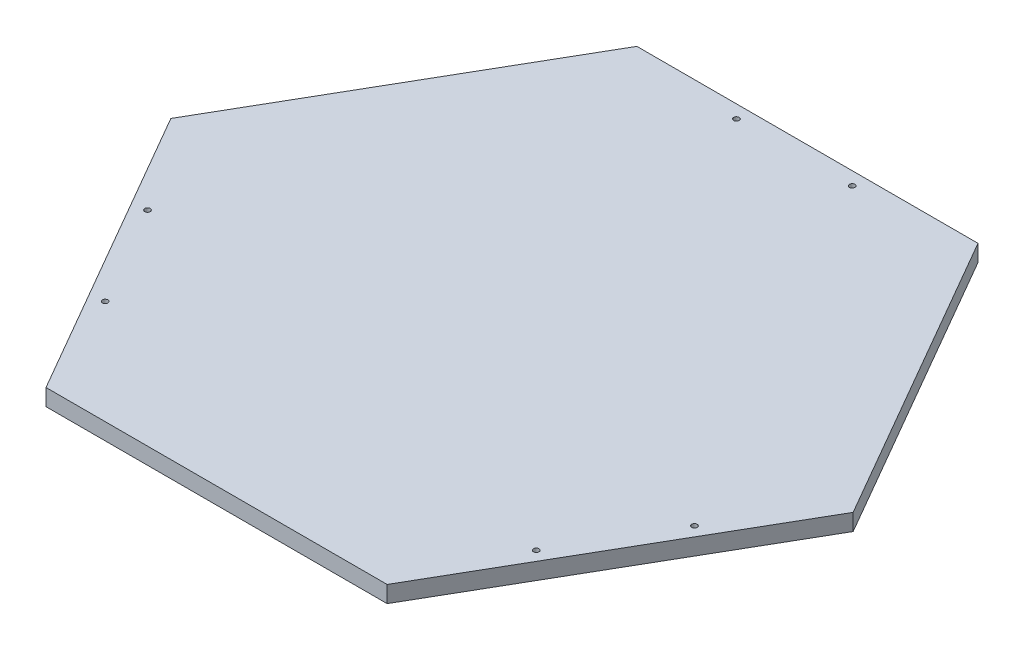
ISO-10303-21;
HEADER;
FILE_DESCRIPTION(('STEP AP214'),'2;1');
FILE_NAME('part.step','',(''),(''),'','','');
FILE_SCHEMA(('AUTOMOTIVE_DESIGN { 1 0 10303 214 1 1 1 1 }'));
ENDSEC;
DATA;
#1=APPLICATION_CONTEXT('core data for automotive mechanical design processes');
#2=APPLICATION_PROTOCOL_DEFINITION('international standard','automotive_design',2000,#1);
#3=PRODUCT_CONTEXT('',#1,'mechanical');
#4=PRODUCT('Part','Part','',(#3));
#5=PRODUCT_RELATED_PRODUCT_CATEGORY('part','',(#4));
#6=PRODUCT_DEFINITION_FORMATION('','',#4);
#7=PRODUCT_DEFINITION_CONTEXT('part definition',#1,'design');
#8=PRODUCT_DEFINITION('design','',#6,#7);
#9=PRODUCT_DEFINITION_SHAPE('','',#8);
#10=(LENGTH_UNIT() NAMED_UNIT(*) SI_UNIT(.MILLI.,.METRE.));
#11=(NAMED_UNIT(*) PLANE_ANGLE_UNIT() SI_UNIT($,.RADIAN.));
#12=(NAMED_UNIT(*) SI_UNIT($,.STERADIAN.) SOLID_ANGLE_UNIT());
#13=UNCERTAINTY_MEASURE_WITH_UNIT(LENGTH_MEASURE(1.E-05),#10,'distance_accuracy_value','');
#14=(GEOMETRIC_REPRESENTATION_CONTEXT(3) GLOBAL_UNCERTAINTY_ASSIGNED_CONTEXT((#13)) GLOBAL_UNIT_ASSIGNED_CONTEXT((#10,
#11,#12)) REPRESENTATION_CONTEXT('',''));
#15=CARTESIAN_POINT('',(0.,0.,0.));
#16=DIRECTION('',(0.,0.,1.));
#17=DIRECTION('',(1.,0.,0.));
#18=AXIS2_PLACEMENT_3D('',#15,#16,#17);
#19=CARTESIAN_POINT('',(-130.207581625282,12.7,225.52614690566));
#20=DIRECTION('',(0.,0.,-1.));
#21=DIRECTION('',(-1.,0.,0.));
#22=AXIS2_PLACEMENT_3D('',#19,#20,#21);
#23=PLANE('',#22);
#24=DIRECTION('',(1.,0.,0.));
#25=VECTOR('',#24,1.);
#26=CARTESIAN_POINT('',(-130.207581625282,0.,225.52614690566));
#27=LINE('',#26,#25);
#28=CARTESIAN_POINT('',(-130.207581625282,0.,225.52614690566));
#29=VERTEX_POINT('',#28);
#30=CARTESIAN_POINT('',(130.207581625282,0.,225.52614690566));
#31=VERTEX_POINT('',#30);
#32=EDGE_CURVE('E118',#29,#31,#27,.T.);
#33=ORIENTED_EDGE('',*,*,#32,.T.);
#34=DIRECTION('',(0.,-1.,0.));
#35=VECTOR('',#34,1.);
#36=CARTESIAN_POINT('',(130.207581625282,12.7,225.52614690566));
#37=LINE('',#36,#35);
#38=CARTESIAN_POINT('',(130.207581625282,12.7,225.52614690566));
#39=VERTEX_POINT('',#38);
#40=EDGE_CURVE('E11',#39,#31,#37,.T.);
#41=ORIENTED_EDGE('',*,*,#40,.F.);
#42=DIRECTION('',(1.,0.,0.));
#43=VECTOR('',#42,1.);
#44=CARTESIAN_POINT('',(-130.207581625282,12.7,225.52614690566));
#45=LINE('',#44,#43);
#46=CARTESIAN_POINT('',(-130.207581625282,12.7,225.52614690566));
#47=VERTEX_POINT('',#46);
#48=EDGE_CURVE('E129',#47,#39,#45,.T.);
#49=ORIENTED_EDGE('',*,*,#48,.F.);
#50=DIRECTION('',(0.,-1.,0.));
#51=VECTOR('',#50,1.);
#52=CARTESIAN_POINT('',(-130.207581625282,12.7,225.52614690566));
#53=LINE('',#52,#51);
#54=EDGE_CURVE('E114',#47,#29,#53,.T.);
#55=ORIENTED_EDGE('',*,*,#54,.T.);
#56=EDGE_LOOP('',(#33,#41,#49,#55));
#57=FACE_BOUND('',#56,.T.);
#58=ADVANCED_FACE('F34',(#57),#23,.F.);
#59=CARTESIAN_POINT('',(130.207581625282,12.7,225.52614690566));
#60=DIRECTION('',(-0.866025403784439,0.,-0.5));
#61=DIRECTION('',(-0.5,0.,0.866025403784439));
#62=AXIS2_PLACEMENT_3D('',#59,#60,#61);
#63=PLANE('',#62);
#64=DIRECTION('',(0.5,0.,-0.866025403784439));
#65=VECTOR('',#64,1.);
#66=CARTESIAN_POINT('',(130.207581625282,0.,225.52614690566));
#67=LINE('',#66,#65);
#68=CARTESIAN_POINT('',(260.415163250563,0.,0.));
#69=VERTEX_POINT('',#68);
#70=EDGE_CURVE('E121',#31,#69,#67,.T.);
#71=ORIENTED_EDGE('',*,*,#70,.T.);
#72=DIRECTION('',(0.,-1.,0.));
#73=VECTOR('',#72,1.);
#74=CARTESIAN_POINT('',(260.415163250563,12.7,0.));
#75=LINE('',#74,#73);
#76=CARTESIAN_POINT('',(260.415163250563,12.7,0.));
#77=VERTEX_POINT('',#76);
#78=EDGE_CURVE('E42',#77,#69,#75,.T.);
#79=ORIENTED_EDGE('',*,*,#78,.F.);
#80=DIRECTION('',(0.5,0.,-0.866025403784439));
#81=VECTOR('',#80,1.);
#82=CARTESIAN_POINT('',(130.207581625282,12.7,225.52614690566));
#83=LINE('',#82,#81);
#84=EDGE_CURVE('E87',#39,#77,#83,.T.);
#85=ORIENTED_EDGE('',*,*,#84,.F.);
#86=ORIENTED_EDGE('',*,*,#40,.T.);
#87=EDGE_LOOP('',(#71,#79,#85,#86));
#88=FACE_BOUND('',#87,.T.);
#89=ADVANCED_FACE('F154',(#88),#63,.F.);
#90=CARTESIAN_POINT('',(260.415163250563,12.7,0.));
#91=DIRECTION('',(-0.866025403784438,0.,0.5));
#92=DIRECTION('',(0.5,0.,0.866025403784439));
#93=AXIS2_PLACEMENT_3D('',#90,#91,#92);
#94=PLANE('',#93);
#95=DIRECTION('',(-0.5,0.,-0.866025403784438));
#96=VECTOR('',#95,1.);
#97=CARTESIAN_POINT('',(260.415163250563,0.,0.));
#98=LINE('',#97,#96);
#99=CARTESIAN_POINT('',(130.207581625282,0.,-225.52614690566));
#100=VERTEX_POINT('',#99);
#101=EDGE_CURVE('E124',#69,#100,#98,.T.);
#102=ORIENTED_EDGE('',*,*,#101,.T.);
#103=DIRECTION('',(0.,-1.,0.));
#104=VECTOR('',#103,1.);
#105=CARTESIAN_POINT('',(130.207581625282,12.7,-225.52614690566));
#106=LINE('',#105,#104);
#107=CARTESIAN_POINT('',(130.207581625282,12.7,-225.52614690566));
#108=VERTEX_POINT('',#107);
#109=EDGE_CURVE('E109',#108,#100,#106,.T.);
#110=ORIENTED_EDGE('',*,*,#109,.F.);
#111=DIRECTION('',(-0.5,0.,-0.866025403784438));
#112=VECTOR('',#111,1.);
#113=CARTESIAN_POINT('',(260.415163250563,12.7,0.));
#114=LINE('',#113,#112);
#115=EDGE_CURVE('E100',#77,#108,#114,.T.);
#116=ORIENTED_EDGE('',*,*,#115,.F.);
#117=ORIENTED_EDGE('',*,*,#78,.T.);
#118=EDGE_LOOP('',(#102,#110,#116,#117));
#119=FACE_BOUND('',#118,.T.);
#120=ADVANCED_FACE('F135',(#119),#94,.F.);
#121=CARTESIAN_POINT('',(130.207581625282,12.7,-225.52614690566));
#122=DIRECTION('',(0.,0.,1.));
#123=DIRECTION('',(1.,0.,0.));
#124=AXIS2_PLACEMENT_3D('',#121,#122,#123);
#125=PLANE('',#124);
#126=DIRECTION('',(-1.,0.,0.));
#127=VECTOR('',#126,1.);
#128=CARTESIAN_POINT('',(130.207581625282,0.,-225.52614690566));
#129=LINE('',#128,#127);
#130=CARTESIAN_POINT('',(-130.207581625282,0.,-225.52614690566));
#131=VERTEX_POINT('',#130);
#132=EDGE_CURVE('E108',#100,#131,#129,.T.);
#133=ORIENTED_EDGE('',*,*,#132,.T.);
#134=DIRECTION('',(0.,-1.,0.));
#135=VECTOR('',#134,1.);
#136=CARTESIAN_POINT('',(-130.207581625282,12.7,-225.52614690566));
#137=LINE('',#136,#135);
#138=CARTESIAN_POINT('',(-130.207581625282,12.7,-225.52614690566));
#139=VERTEX_POINT('',#138);
#140=EDGE_CURVE('E105',#139,#131,#137,.T.);
#141=ORIENTED_EDGE('',*,*,#140,.F.);
#142=DIRECTION('',(-1.,0.,0.));
#143=VECTOR('',#142,1.);
#144=CARTESIAN_POINT('',(130.207581625282,12.7,-225.52614690566));
#145=LINE('',#144,#143);
#146=EDGE_CURVE('E94',#108,#139,#145,.T.);
#147=ORIENTED_EDGE('',*,*,#146,.F.);
#148=ORIENTED_EDGE('',*,*,#109,.T.);
#149=EDGE_LOOP('',(#133,#141,#147,#148));
#150=FACE_BOUND('',#149,.T.);
#151=ADVANCED_FACE('F106',(#150),#125,.F.);
#152=CARTESIAN_POINT('',(-130.207581625282,12.7,-225.52614690566));
#153=DIRECTION('',(0.866025403784439,0.,0.5));
#154=DIRECTION('',(0.5,0.,-0.866025403784439));
#155=AXIS2_PLACEMENT_3D('',#152,#153,#154);
#156=PLANE('',#155);
#157=DIRECTION('',(-0.5,0.,0.866025403784439));
#158=VECTOR('',#157,1.);
#159=CARTESIAN_POINT('',(-130.207581625282,0.,-225.52614690566));
#160=LINE('',#159,#158);
#161=CARTESIAN_POINT('',(-260.415163250563,0.,0.));
#162=VERTEX_POINT('',#161);
#163=EDGE_CURVE('E73',#131,#162,#160,.T.);
#164=ORIENTED_EDGE('',*,*,#163,.T.);
#165=DIRECTION('',(0.,-1.,0.));
#166=VECTOR('',#165,1.);
#167=CARTESIAN_POINT('',(-260.415163250563,12.7,0.));
#168=LINE('',#167,#166);
#169=CARTESIAN_POINT('',(-260.415163250563,12.7,0.));
#170=VERTEX_POINT('',#169);
#171=EDGE_CURVE('E110',#170,#162,#168,.T.);
#172=ORIENTED_EDGE('',*,*,#171,.F.);
#173=DIRECTION('',(-0.5,0.,0.866025403784439));
#174=VECTOR('',#173,1.);
#175=CARTESIAN_POINT('',(-130.207581625282,12.7,-225.52614690566));
#176=LINE('',#175,#174);
#177=EDGE_CURVE('E98',#139,#170,#176,.T.);
#178=ORIENTED_EDGE('',*,*,#177,.F.);
#179=ORIENTED_EDGE('',*,*,#140,.T.);
#180=EDGE_LOOP('',(#164,#172,#178,#179));
#181=FACE_BOUND('',#180,.T.);
#182=ADVANCED_FACE('F112',(#181),#156,.F.);
#183=CARTESIAN_POINT('',(-260.415163250563,12.7,0.));
#184=DIRECTION('',(0.866025403784439,0.,-0.5));
#185=DIRECTION('',(-0.5,0.,-0.866025403784439));
#186=AXIS2_PLACEMENT_3D('',#183,#184,#185);
#187=PLANE('',#186);
#188=DIRECTION('',(0.5,0.,0.866025403784439));
#189=VECTOR('',#188,1.);
#190=CARTESIAN_POINT('',(-260.415163250563,0.,0.));
#191=LINE('',#190,#189);
#192=EDGE_CURVE('E79',#162,#29,#191,.T.);
#193=ORIENTED_EDGE('',*,*,#192,.T.);
#194=ORIENTED_EDGE('',*,*,#54,.F.);
#195=DIRECTION('',(0.5,0.,0.866025403784439));
#196=VECTOR('',#195,1.);
#197=CARTESIAN_POINT('',(-260.415163250563,12.7,0.));
#198=LINE('',#197,#196);
#199=EDGE_CURVE('E50',#170,#47,#198,.T.);
#200=ORIENTED_EDGE('',*,*,#199,.F.);
#201=ORIENTED_EDGE('',*,*,#171,.T.);
#202=EDGE_LOOP('',(#193,#194,#200,#201));
#203=FACE_BOUND('',#202,.T.);
#204=ADVANCED_FACE('F142',(#203),#187,.F.);
#205=CARTESIAN_POINT('',(0.,12.7,0.));
#206=DIRECTION('',(0.,1.,0.));
#207=DIRECTION('',(0.,0.,1.));
#208=AXIS2_PLACEMENT_3D('',#205,#206,#207);
#209=PLANE('',#208);
#210=CARTESIAN_POINT('',(-44.2075816252818,12.7,-215.52614690566));
#211=DIRECTION('',(0.,1.,0.));
#212=DIRECTION('',(0.,0.,1.));
#213=AXIS2_PLACEMENT_3D('',#210,#211,#212);
#214=CIRCLE('',#213,2.1);
#215=CARTESIAN_POINT('',(-44.2075816252818,12.7,-213.42614690566));
#216=VERTEX_POINT('',#215);
#217=EDGE_CURVE('E260',#216,#216,#214,.T.);
#218=ORIENTED_EDGE('',*,*,#217,.F.);
#219=EDGE_LOOP('',(#218));
#220=FACE_BOUND('',#219,.T.);
#221=CARTESIAN_POINT('',(44.2075816252818,12.7,-215.52614690566));
#222=DIRECTION('',(0.,1.,0.));
#223=DIRECTION('',(0.,0.,1.));
#224=AXIS2_PLACEMENT_3D('',#221,#222,#223);
#225=CIRCLE('',#224,2.1);
#226=CARTESIAN_POINT('',(44.2075816252818,12.7,-213.42614690566));
#227=VERTEX_POINT('',#226);
#228=EDGE_CURVE('E262',#227,#227,#225,.T.);
#229=ORIENTED_EDGE('',*,*,#228,.F.);
#230=EDGE_LOOP('',(#229));
#231=FACE_BOUND('',#230,.T.);
#232=CARTESIAN_POINT('',(-208.754909212719,12.7,69.4781847254617));
#233=DIRECTION('',(0.,1.,0.));
#234=DIRECTION('',(0.,0.,1.));
#235=AXIS2_PLACEMENT_3D('',#232,#233,#234);
#236=CIRCLE('',#235,2.09999999999999);
#237=CARTESIAN_POINT('',(-208.754909212719,12.7,71.5781847254617));
#238=VERTEX_POINT('',#237);
#239=EDGE_CURVE('E270',#238,#238,#236,.T.);
#240=ORIENTED_EDGE('',*,*,#239,.F.);
#241=EDGE_LOOP('',(#240));
#242=FACE_BOUND('',#241,.T.);
#243=CARTESIAN_POINT('',(-164.547327587437,12.7,146.047962180198));
#244=DIRECTION('',(0.,1.,0.));
#245=DIRECTION('',(0.,0.,1.));
#246=AXIS2_PLACEMENT_3D('',#243,#244,#245);
#247=CIRCLE('',#246,2.09999999999999);
#248=CARTESIAN_POINT('',(-164.547327587437,12.7,148.147962180198));
#249=VERTEX_POINT('',#248);
#250=EDGE_CURVE('E276',#249,#249,#247,.T.);
#251=ORIENTED_EDGE('',*,*,#250,.F.);
#252=EDGE_LOOP('',(#251));
#253=FACE_BOUND('',#252,.T.);
#254=CARTESIAN_POINT('',(164.547327587437,12.7,146.047962180197));
#255=DIRECTION('',(0.,1.,0.));
#256=DIRECTION('',(0.,0.,1.));
#257=AXIS2_PLACEMENT_3D('',#254,#255,#256);
#258=CIRCLE('',#257,2.09999999999999);
#259=CARTESIAN_POINT('',(164.547327587437,12.7,148.147962180197));
#260=VERTEX_POINT('',#259);
#261=EDGE_CURVE('E282',#260,#260,#258,.T.);
#262=ORIENTED_EDGE('',*,*,#261,.F.);
#263=EDGE_LOOP('',(#262));
#264=FACE_BOUND('',#263,.T.);
#265=CARTESIAN_POINT('',(208.754909212719,12.7,69.4781847254604));
#266=DIRECTION('',(0.,1.,0.));
#267=DIRECTION('',(0.,0.,1.));
#268=AXIS2_PLACEMENT_3D('',#265,#266,#267);
#269=CIRCLE('',#268,2.09999999999999);
#270=CARTESIAN_POINT('',(208.754909212719,12.7,71.5781847254603));
#271=VERTEX_POINT('',#270);
#272=EDGE_CURVE('E288',#271,#271,#269,.T.);
#273=ORIENTED_EDGE('',*,*,#272,.F.);
#274=EDGE_LOOP('',(#273));
#275=FACE_BOUND('',#274,.T.);
#276=ORIENTED_EDGE('',*,*,#48,.T.);
#277=ORIENTED_EDGE('',*,*,#84,.T.);
#278=ORIENTED_EDGE('',*,*,#115,.T.);
#279=ORIENTED_EDGE('',*,*,#146,.T.);
#280=ORIENTED_EDGE('',*,*,#177,.T.);
#281=ORIENTED_EDGE('',*,*,#199,.T.);
#282=EDGE_LOOP('',(#276,#277,#278,#279,#280,#281));
#283=FACE_BOUND('',#282,.T.);
#284=ADVANCED_FACE('F96',(#220,#231,#242,#253,#264,#275,#283),#209,.T.);
#285=CARTESIAN_POINT('',(0.,0.,0.));
#286=DIRECTION('',(0.,1.,0.));
#287=DIRECTION('',(0.,0.,1.));
#288=AXIS2_PLACEMENT_3D('',#285,#286,#287);
#289=PLANE('',#288);
#290=CARTESIAN_POINT('',(-44.2075816252818,0.,-215.52614690566));
#291=DIRECTION('',(0.,1.,0.));
#292=DIRECTION('',(0.,0.,1.));
#293=AXIS2_PLACEMENT_3D('',#290,#291,#292);
#294=CIRCLE('',#293,2.1);
#295=CARTESIAN_POINT('',(-44.2075816252818,0.,-213.42614690566));
#296=VERTEX_POINT('',#295);
#297=EDGE_CURVE('E257',#296,#296,#294,.T.);
#298=ORIENTED_EDGE('',*,*,#297,.T.);
#299=EDGE_LOOP('',(#298));
#300=FACE_BOUND('',#299,.T.);
#301=CARTESIAN_POINT('',(44.2075816252818,0.,-215.52614690566));
#302=DIRECTION('',(0.,1.,0.));
#303=DIRECTION('',(0.,0.,1.));
#304=AXIS2_PLACEMENT_3D('',#301,#302,#303);
#305=CIRCLE('',#304,2.1);
#306=CARTESIAN_POINT('',(44.2075816252818,0.,-213.42614690566));
#307=VERTEX_POINT('',#306);
#308=EDGE_CURVE('E267',#307,#307,#305,.T.);
#309=ORIENTED_EDGE('',*,*,#308,.T.);
#310=EDGE_LOOP('',(#309));
#311=FACE_BOUND('',#310,.T.);
#312=CARTESIAN_POINT('',(-208.754909212719,0.,69.4781847254617));
#313=DIRECTION('',(0.,1.,0.));
#314=DIRECTION('',(0.,0.,1.));
#315=AXIS2_PLACEMENT_3D('',#312,#313,#314);
#316=CIRCLE('',#315,2.09999999999999);
#317=CARTESIAN_POINT('',(-208.754909212719,0.,71.5781847254617));
#318=VERTEX_POINT('',#317);
#319=EDGE_CURVE('E273',#318,#318,#316,.T.);
#320=ORIENTED_EDGE('',*,*,#319,.T.);
#321=EDGE_LOOP('',(#320));
#322=FACE_BOUND('',#321,.T.);
#323=CARTESIAN_POINT('',(-164.547327587437,0.,146.047962180198));
#324=DIRECTION('',(0.,1.,0.));
#325=DIRECTION('',(0.,0.,1.));
#326=AXIS2_PLACEMENT_3D('',#323,#324,#325);
#327=CIRCLE('',#326,2.09999999999999);
#328=CARTESIAN_POINT('',(-164.547327587437,0.,148.147962180198));
#329=VERTEX_POINT('',#328);
#330=EDGE_CURVE('E279',#329,#329,#327,.T.);
#331=ORIENTED_EDGE('',*,*,#330,.T.);
#332=EDGE_LOOP('',(#331));
#333=FACE_BOUND('',#332,.T.);
#334=CARTESIAN_POINT('',(164.547327587437,0.,146.047962180197));
#335=DIRECTION('',(0.,1.,0.));
#336=DIRECTION('',(0.,0.,1.));
#337=AXIS2_PLACEMENT_3D('',#334,#335,#336);
#338=CIRCLE('',#337,2.09999999999999);
#339=CARTESIAN_POINT('',(164.547327587437,0.,148.147962180197));
#340=VERTEX_POINT('',#339);
#341=EDGE_CURVE('E285',#340,#340,#338,.T.);
#342=ORIENTED_EDGE('',*,*,#341,.T.);
#343=EDGE_LOOP('',(#342));
#344=FACE_BOUND('',#343,.T.);
#345=CARTESIAN_POINT('',(208.754909212719,0.,69.4781847254604));
#346=DIRECTION('',(0.,1.,0.));
#347=DIRECTION('',(0.,0.,1.));
#348=AXIS2_PLACEMENT_3D('',#345,#346,#347);
#349=CIRCLE('',#348,2.09999999999999);
#350=CARTESIAN_POINT('',(208.754909212719,0.,71.5781847254603));
#351=VERTEX_POINT('',#350);
#352=EDGE_CURVE('E122',#351,#351,#349,.T.);
#353=ORIENTED_EDGE('',*,*,#352,.T.);
#354=EDGE_LOOP('',(#353));
#355=FACE_BOUND('',#354,.T.);
#356=ORIENTED_EDGE('',*,*,#32,.F.);
#357=ORIENTED_EDGE('',*,*,#192,.F.);
#358=ORIENTED_EDGE('',*,*,#163,.F.);
#359=ORIENTED_EDGE('',*,*,#132,.F.);
#360=ORIENTED_EDGE('',*,*,#101,.F.);
#361=ORIENTED_EDGE('',*,*,#70,.F.);
#362=EDGE_LOOP('',(#356,#357,#358,#359,#360,#361));
#363=FACE_BOUND('',#362,.T.);
#364=ADVANCED_FACE('F138',(#300,#311,#322,#333,#344,#355,#363),#289,.F.);
#365=CARTESIAN_POINT('',(208.754909212719,12.7,69.4781847254604));
#366=DIRECTION('',(0.,1.,0.));
#367=DIRECTION('',(0.,0.,1.));
#368=AXIS2_PLACEMENT_3D('',#365,#366,#367);
#369=CYLINDRICAL_SURFACE('',#368,2.09999999999999);
#370=ORIENTED_EDGE('',*,*,#352,.F.);
#371=EDGE_LOOP('',(#370));
#372=FACE_BOUND('',#371,.T.);
#373=ORIENTED_EDGE('',*,*,#272,.T.);
#374=EDGE_LOOP('',(#373));
#375=FACE_BOUND('',#374,.T.);
#376=ADVANCED_FACE('F191',(#372,#375),#369,.F.);
#377=CARTESIAN_POINT('',(164.547327587437,12.7,146.047962180197));
#378=DIRECTION('',(0.,1.,0.));
#379=DIRECTION('',(0.,0.,1.));
#380=AXIS2_PLACEMENT_3D('',#377,#378,#379);
#381=CYLINDRICAL_SURFACE('',#380,2.09999999999999);
#382=ORIENTED_EDGE('',*,*,#341,.F.);
#383=EDGE_LOOP('',(#382));
#384=FACE_BOUND('',#383,.T.);
#385=ORIENTED_EDGE('',*,*,#261,.T.);
#386=EDGE_LOOP('',(#385));
#387=FACE_BOUND('',#386,.T.);
#388=ADVANCED_FACE('F200',(#384,#387),#381,.F.);
#389=CARTESIAN_POINT('',(-164.547327587437,12.7,146.047962180198));
#390=DIRECTION('',(0.,1.,0.));
#391=DIRECTION('',(0.,0.,1.));
#392=AXIS2_PLACEMENT_3D('',#389,#390,#391);
#393=CYLINDRICAL_SURFACE('',#392,2.09999999999999);
#394=ORIENTED_EDGE('',*,*,#330,.F.);
#395=EDGE_LOOP('',(#394));
#396=FACE_BOUND('',#395,.T.);
#397=ORIENTED_EDGE('',*,*,#250,.T.);
#398=EDGE_LOOP('',(#397));
#399=FACE_BOUND('',#398,.T.);
#400=ADVANCED_FACE('F210',(#396,#399),#393,.F.);
#401=CARTESIAN_POINT('',(-208.754909212719,12.7,69.4781847254617));
#402=DIRECTION('',(0.,1.,0.));
#403=DIRECTION('',(0.,0.,1.));
#404=AXIS2_PLACEMENT_3D('',#401,#402,#403);
#405=CYLINDRICAL_SURFACE('',#404,2.09999999999999);
#406=ORIENTED_EDGE('',*,*,#319,.F.);
#407=EDGE_LOOP('',(#406));
#408=FACE_BOUND('',#407,.T.);
#409=ORIENTED_EDGE('',*,*,#239,.T.);
#410=EDGE_LOOP('',(#409));
#411=FACE_BOUND('',#410,.T.);
#412=ADVANCED_FACE('F220',(#408,#411),#405,.F.);
#413=CARTESIAN_POINT('',(44.2075816252818,12.7,-215.52614690566));
#414=DIRECTION('',(0.,1.,0.));
#415=DIRECTION('',(0.,0.,1.));
#416=AXIS2_PLACEMENT_3D('',#413,#414,#415);
#417=CYLINDRICAL_SURFACE('',#416,2.1);
#418=ORIENTED_EDGE('',*,*,#308,.F.);
#419=EDGE_LOOP('',(#418));
#420=FACE_BOUND('',#419,.T.);
#421=ORIENTED_EDGE('',*,*,#228,.T.);
#422=EDGE_LOOP('',(#421));
#423=FACE_BOUND('',#422,.T.);
#424=ADVANCED_FACE('F230',(#420,#423),#417,.F.);
#425=CARTESIAN_POINT('',(-44.2075816252818,12.7,-215.52614690566));
#426=DIRECTION('',(0.,1.,0.));
#427=DIRECTION('',(0.,0.,1.));
#428=AXIS2_PLACEMENT_3D('',#425,#426,#427);
#429=CYLINDRICAL_SURFACE('',#428,2.1);
#430=ORIENTED_EDGE('',*,*,#297,.F.);
#431=EDGE_LOOP('',(#430));
#432=FACE_BOUND('',#431,.T.);
#433=ORIENTED_EDGE('',*,*,#217,.T.);
#434=EDGE_LOOP('',(#433));
#435=FACE_BOUND('',#434,.T.);
#436=ADVANCED_FACE('F240',(#432,#435),#429,.F.);
#437=CLOSED_SHELL('',(#58,#89,#120,#151,#182,#204,#284,#364,#376,#388,#400,#412,#424,#436));
#438=MANIFOLD_SOLID_BREP('B2',#437);
#439=ADVANCED_BREP_SHAPE_REPRESENTATION('',(#18,#438),#14);
#440=SHAPE_DEFINITION_REPRESENTATION(#9,#439);
ENDSEC;
END-ISO-10303-21;
